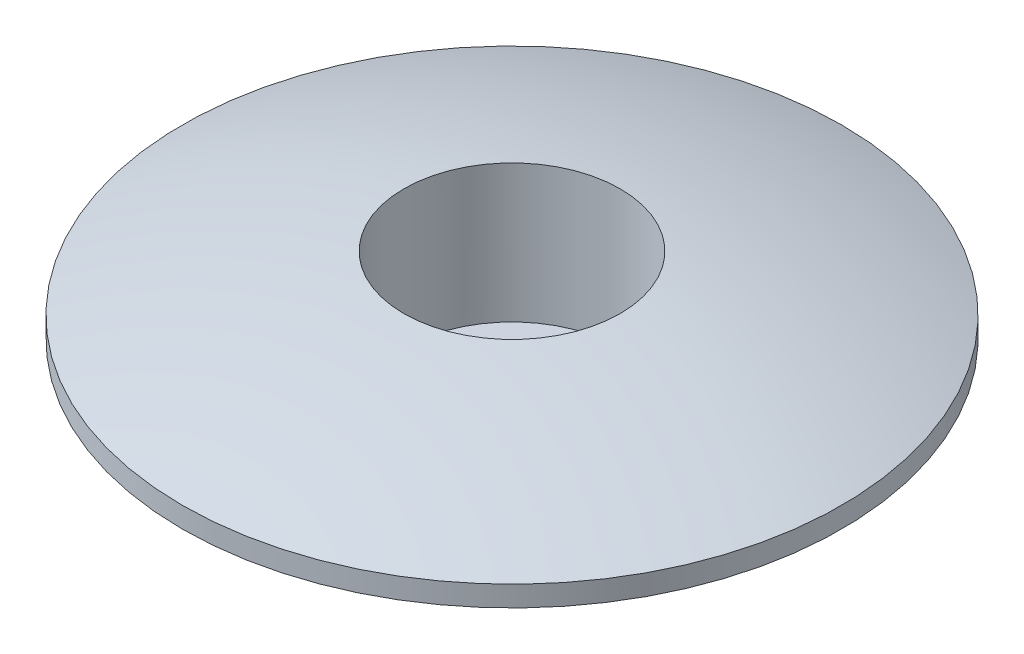
ISO-10303-21;
HEADER;
FILE_DESCRIPTION(('STEP AP214'),'2;1');
FILE_NAME('part.step','',(''),(''),'','','');
FILE_SCHEMA(('AUTOMOTIVE_DESIGN { 1 0 10303 214 1 1 1 1 }'));
ENDSEC;
DATA;
#1=APPLICATION_CONTEXT('core data for automotive mechanical design processes');
#2=APPLICATION_PROTOCOL_DEFINITION('international standard','automotive_design',2000,#1);
#3=PRODUCT_CONTEXT('',#1,'mechanical');
#4=PRODUCT('Part','Part','',(#3));
#5=PRODUCT_RELATED_PRODUCT_CATEGORY('part','',(#4));
#6=PRODUCT_DEFINITION_FORMATION('','',#4);
#7=PRODUCT_DEFINITION_CONTEXT('part definition',#1,'design');
#8=PRODUCT_DEFINITION('design','',#6,#7);
#9=PRODUCT_DEFINITION_SHAPE('','',#8);
#10=(LENGTH_UNIT() NAMED_UNIT(*) SI_UNIT(.MILLI.,.METRE.));
#11=(NAMED_UNIT(*) PLANE_ANGLE_UNIT() SI_UNIT($,.RADIAN.));
#12=(NAMED_UNIT(*) SI_UNIT($,.STERADIAN.) SOLID_ANGLE_UNIT());
#13=UNCERTAINTY_MEASURE_WITH_UNIT(LENGTH_MEASURE(1.E-05),#10,'distance_accuracy_value','');
#14=(GEOMETRIC_REPRESENTATION_CONTEXT(3) GLOBAL_UNCERTAINTY_ASSIGNED_CONTEXT((#13)) GLOBAL_UNIT_ASSIGNED_CONTEXT((#10,
#11,#12)) REPRESENTATION_CONTEXT('',''));
#15=CARTESIAN_POINT('',(0.,0.,0.));
#16=DIRECTION('',(0.,0.,1.));
#17=DIRECTION('',(1.,0.,0.));
#18=AXIS2_PLACEMENT_3D('',#15,#16,#17);
#19=CARTESIAN_POINT('',(0.,18.46130707427,0.));
#20=DIRECTION('',(0.,1.,0.));
#21=DIRECTION('',(0.,0.,1.));
#22=AXIS2_PLACEMENT_3D('',#19,#20,#21);
#23=CYLINDRICAL_SURFACE('',#22,14.25);
#24=CARTESIAN_POINT('',(0.,4.5,0.));
#25=DIRECTION('',(0.,1.,0.));
#26=DIRECTION('',(0.,0.,1.));
#27=AXIS2_PLACEMENT_3D('',#24,#25,#26);
#28=CIRCLE('',#27,14.25);
#29=CARTESIAN_POINT('',(0.,4.5,14.25));
#30=VERTEX_POINT('',#29);
#31=EDGE_CURVE('E10',#30,#30,#28,.T.);
#32=ORIENTED_EDGE('',*,*,#31,.T.);
#33=EDGE_LOOP('',(#32));
#34=FACE_BOUND('',#33,.T.);
#35=CARTESIAN_POINT('',(0.,5.5,0.));
#36=DIRECTION('',(0.,1.,0.));
#37=DIRECTION('',(0.,0.,1.));
#38=AXIS2_PLACEMENT_3D('',#35,#36,#37);
#39=CIRCLE('',#38,14.25);
#40=CARTESIAN_POINT('',(0.,5.5,14.25));
#41=VERTEX_POINT('',#40);
#42=EDGE_CURVE('E53',#41,#41,#39,.T.);
#43=ORIENTED_EDGE('',*,*,#42,.F.);
#44=EDGE_LOOP('',(#43));
#45=FACE_BOUND('',#44,.T.);
#46=ADVANCED_FACE('F24',(#34,#45),#23,.T.);
#47=CARTESIAN_POINT('',(0.,-7.25694444444445,0.));
#48=DIRECTION('',(0.,1.,0.));
#49=DIRECTION('',(0.,0.,1.));
#50=AXIS2_PLACEMENT_3D('',#47,#48,#49);
#51=TOROIDAL_SURFACE('',#50,14.25,11.7569444444445);
#52=CARTESIAN_POINT('',(0.,0.,0.));
#53=DIRECTION('',(0.,1.,0.));
#54=DIRECTION('',(0.,0.,1.));
#55=AXIS2_PLACEMENT_3D('',#52,#53,#54);
#56=CIRCLE('',#55,5.);
#57=CARTESIAN_POINT('',(0.,0.,5.));
#58=VERTEX_POINT('',#57);
#59=EDGE_CURVE('E31',#58,#58,#56,.T.);
#60=ORIENTED_EDGE('',*,*,#59,.T.);
#61=EDGE_LOOP('',(#60));
#62=FACE_BOUND('',#61,.T.);
#63=ORIENTED_EDGE('',*,*,#31,.F.);
#64=EDGE_LOOP('',(#63));
#65=FACE_BOUND('',#64,.T.);
#66=ADVANCED_FACE('F79',(#62,#65),#51,.F.);
#67=CARTESIAN_POINT('',(0.,0.,0.));
#68=DIRECTION('',(0.,-1.,0.));
#69=DIRECTION('',(0.,0.,-1.));
#70=AXIS2_PLACEMENT_3D('',#67,#68,#69);
#71=PLANE('',#70);
#72=CARTESIAN_POINT('',(0.,0.,0.));
#73=DIRECTION('',(0.,-1.,0.));
#74=DIRECTION('',(0.,0.,-1.));
#75=AXIS2_PLACEMENT_3D('',#72,#73,#74);
#76=CIRCLE('',#75,3.25);
#77=CARTESIAN_POINT('',(0.,0.,-3.25));
#78=VERTEX_POINT('',#77);
#79=EDGE_CURVE('E45',#78,#78,#76,.T.);
#80=ORIENTED_EDGE('',*,*,#79,.F.);
#81=EDGE_LOOP('',(#80));
#82=FACE_BOUND('',#81,.T.);
#83=ORIENTED_EDGE('',*,*,#59,.F.);
#84=EDGE_LOOP('',(#83));
#85=FACE_BOUND('',#84,.T.);
#86=ADVANCED_FACE('F75',(#82,#85),#71,.T.);
#87=CARTESIAN_POINT('',(0.,-34.6666666666667,0.));
#88=DIRECTION('',(0.,1.,0.));
#89=DIRECTION('',(-1.,0.,0.));
#90=AXIS2_PLACEMENT_3D('',#87,#88,#89);
#91=SPHERICAL_SURFACE('',#90,44.1666666666667);
#92=CARTESIAN_POINT('',(0.,9.18686163430866,0.));
#93=DIRECTION('',(0.,-1.,0.));
#94=DIRECTION('',(0.,0.,-1.));
#95=AXIS2_PLACEMENT_3D('',#92,#93,#94);
#96=CIRCLE('',#95,5.25);
#97=CARTESIAN_POINT('',(0.,9.18686163430866,-5.25));
#98=VERTEX_POINT('',#97);
#99=EDGE_CURVE('E27',#98,#98,#96,.F.);
#100=ORIENTED_EDGE('',*,*,#99,.F.);
#101=EDGE_LOOP('',(#100));
#102=FACE_BOUND('',#101,.T.);
#103=CARTESIAN_POINT('',(0.,6.5,0.));
#104=DIRECTION('',(0.,1.,0.));
#105=DIRECTION('',(0.,0.,1.));
#106=AXIS2_PLACEMENT_3D('',#103,#104,#105);
#107=CIRCLE('',#106,16.);
#108=CARTESIAN_POINT('',(0.,6.5,16.));
#109=VERTEX_POINT('',#108);
#110=EDGE_CURVE('E36',#109,#109,#107,.T.);
#111=ORIENTED_EDGE('',*,*,#110,.T.);
#112=EDGE_LOOP('',(#111));
#113=FACE_BOUND('',#112,.T.);
#114=ADVANCED_FACE('F61',(#102,#113),#91,.T.);
#115=CARTESIAN_POINT('',(0.,18.46130707427,0.));
#116=DIRECTION('',(0.,1.,0.));
#117=DIRECTION('',(0.,0.,1.));
#118=AXIS2_PLACEMENT_3D('',#115,#116,#117);
#119=CYLINDRICAL_SURFACE('',#118,16.);
#120=CARTESIAN_POINT('',(0.,5.5,0.));
#121=DIRECTION('',(0.,1.,0.));
#122=DIRECTION('',(0.,0.,1.));
#123=AXIS2_PLACEMENT_3D('',#120,#121,#122);
#124=CIRCLE('',#123,16.);
#125=CARTESIAN_POINT('',(0.,5.5,16.));
#126=VERTEX_POINT('',#125);
#127=EDGE_CURVE('E56',#126,#126,#124,.T.);
#128=ORIENTED_EDGE('',*,*,#127,.T.);
#129=EDGE_LOOP('',(#128));
#130=FACE_BOUND('',#129,.T.);
#131=ORIENTED_EDGE('',*,*,#110,.F.);
#132=EDGE_LOOP('',(#131));
#133=FACE_BOUND('',#132,.T.);
#134=ADVANCED_FACE('F63',(#130,#133),#119,.T.);
#135=CARTESIAN_POINT('',(-16.,5.5,0.));
#136=DIRECTION('',(0.,-1.,0.));
#137=DIRECTION('',(0.,0.,-1.));
#138=AXIS2_PLACEMENT_3D('',#135,#136,#137);
#139=PLANE('',#138);
#140=ORIENTED_EDGE('',*,*,#42,.T.);
#141=EDGE_LOOP('',(#140));
#142=FACE_BOUND('',#141,.T.);
#143=ORIENTED_EDGE('',*,*,#127,.F.);
#144=EDGE_LOOP('',(#143));
#145=FACE_BOUND('',#144,.T.);
#146=ADVANCED_FACE('F65',(#142,#145),#139,.T.);
#147=CARTESIAN_POINT('',(0.,9.5,0.));
#148=DIRECTION('',(0.,-1.,0.));
#149=DIRECTION('',(0.,0.,-1.));
#150=AXIS2_PLACEMENT_3D('',#147,#148,#149);
#151=CYLINDRICAL_SURFACE('',#150,3.25);
#152=CARTESIAN_POINT('',(0.,2.5,0.));
#153=DIRECTION('',(0.,-1.,0.));
#154=DIRECTION('',(0.,0.,-1.));
#155=AXIS2_PLACEMENT_3D('',#152,#153,#154);
#156=CIRCLE('',#155,3.25);
#157=CARTESIAN_POINT('',(0.,2.5,-3.25));
#158=VERTEX_POINT('',#157);
#159=EDGE_CURVE('E39',#158,#158,#156,.F.);
#160=ORIENTED_EDGE('',*,*,#159,.T.);
#161=EDGE_LOOP('',(#160));
#162=FACE_BOUND('',#161,.T.);
#163=ORIENTED_EDGE('',*,*,#79,.T.);
#164=EDGE_LOOP('',(#163));
#165=FACE_BOUND('',#164,.T.);
#166=ADVANCED_FACE('F72',(#162,#165),#151,.F.);
#167=CARTESIAN_POINT('',(0.,2.5,0.));
#168=DIRECTION('',(0.,-1.,0.));
#169=DIRECTION('',(0.,0.,-1.));
#170=AXIS2_PLACEMENT_3D('',#167,#168,#169);
#171=PLANE('',#170);
#172=CARTESIAN_POINT('',(0.,2.5,0.));
#173=DIRECTION('',(0.,-1.,0.));
#174=DIRECTION('',(0.,0.,-1.));
#175=AXIS2_PLACEMENT_3D('',#172,#173,#174);
#176=CIRCLE('',#175,5.25);
#177=CARTESIAN_POINT('',(0.,2.5,-5.25));
#178=VERTEX_POINT('',#177);
#179=EDGE_CURVE('E41',#178,#178,#176,.T.);
#180=ORIENTED_EDGE('',*,*,#179,.F.);
#181=EDGE_LOOP('',(#180));
#182=FACE_BOUND('',#181,.T.);
#183=ORIENTED_EDGE('',*,*,#159,.F.);
#184=EDGE_LOOP('',(#183));
#185=FACE_BOUND('',#184,.T.);
#186=ADVANCED_FACE('F101',(#182,#185),#171,.F.);
#187=CARTESIAN_POINT('',(0.,9.38026222110535,0.));
#188=DIRECTION('',(0.,-1.,0.));
#189=DIRECTION('',(0.,0.,-1.));
#190=AXIS2_PLACEMENT_3D('',#187,#188,#189);
#191=CYLINDRICAL_SURFACE('',#190,5.25);
#192=ORIENTED_EDGE('',*,*,#99,.T.);
#193=EDGE_LOOP('',(#192));
#194=FACE_BOUND('',#193,.T.);
#195=ORIENTED_EDGE('',*,*,#179,.T.);
#196=EDGE_LOOP('',(#195));
#197=FACE_BOUND('',#196,.T.);
#198=ADVANCED_FACE('F106',(#194,#197),#191,.F.);
#199=CLOSED_SHELL('',(#46,#66,#86,#114,#134,#146,#166,#186,#198));
#200=MANIFOLD_SOLID_BREP('B2',#199);
#201=ADVANCED_BREP_SHAPE_REPRESENTATION('',(#18,#200),#14);
#202=SHAPE_DEFINITION_REPRESENTATION(#9,#201);
ENDSEC;
END-ISO-10303-21;
